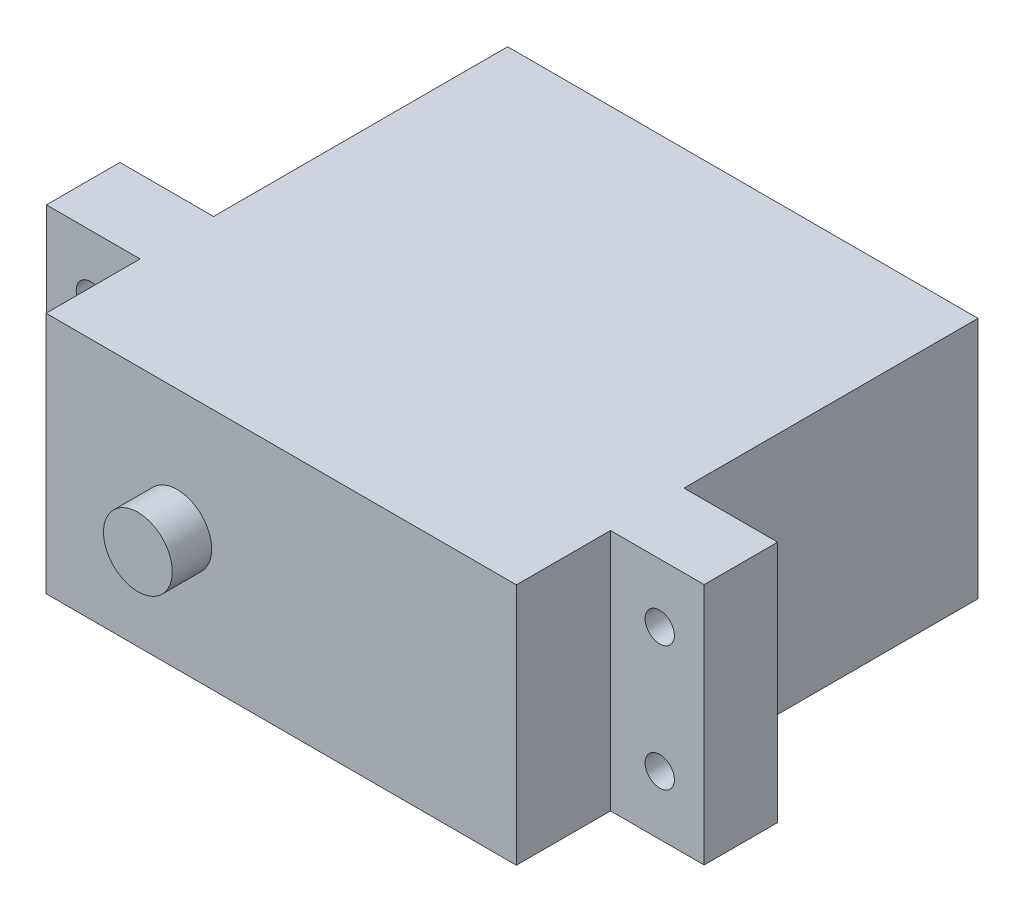
ISO-10303-21;
HEADER;
FILE_DESCRIPTION(('STEP AP214'),'2;1');
FILE_NAME('part.step','',(''),(''),'','','');
FILE_SCHEMA(('AUTOMOTIVE_DESIGN { 1 0 10303 214 1 1 1 1 }'));
ENDSEC;
DATA;
#1=APPLICATION_CONTEXT('core data for automotive mechanical design processes');
#2=APPLICATION_PROTOCOL_DEFINITION('international standard','automotive_design',2000,#1);
#3=PRODUCT_CONTEXT('',#1,'mechanical');
#4=PRODUCT('Part','Part','',(#3));
#5=PRODUCT_RELATED_PRODUCT_CATEGORY('part','',(#4));
#6=PRODUCT_DEFINITION_FORMATION('','',#4);
#7=PRODUCT_DEFINITION_CONTEXT('part definition',#1,'design');
#8=PRODUCT_DEFINITION('design','',#6,#7);
#9=PRODUCT_DEFINITION_SHAPE('','',#8);
#10=(LENGTH_UNIT() NAMED_UNIT(*) SI_UNIT(.MILLI.,.METRE.));
#11=(NAMED_UNIT(*) PLANE_ANGLE_UNIT() SI_UNIT($,.RADIAN.));
#12=(NAMED_UNIT(*) SI_UNIT($,.STERADIAN.) SOLID_ANGLE_UNIT());
#13=UNCERTAINTY_MEASURE_WITH_UNIT(LENGTH_MEASURE(1.E-05),#10,'distance_accuracy_value','');
#14=(GEOMETRIC_REPRESENTATION_CONTEXT(3) GLOBAL_UNCERTAINTY_ASSIGNED_CONTEXT((#13)) GLOBAL_UNIT_ASSIGNED_CONTEXT((#10,
#11,#12)) REPRESENTATION_CONTEXT('',''));
#15=CARTESIAN_POINT('',(0.,0.,0.));
#16=DIRECTION('',(0.,0.,1.));
#17=DIRECTION('',(1.,0.,0.));
#18=AXIS2_PLACEMENT_3D('',#15,#16,#17);
#19=CARTESIAN_POINT('',(-28.4099,-10.4902,43.2816));
#20=DIRECTION('',(1.,0.,0.));
#21=DIRECTION('',(0.,0.,-1.));
#22=AXIS2_PLACEMENT_3D('',#19,#20,#21);
#23=PLANE('',#22);
#24=DIRECTION('',(0.,0.,-1.));
#25=VECTOR('',#24,1.);
#26=CARTESIAN_POINT('',(-28.4099,-10.4902,43.2816));
#27=LINE('',#26,#25);
#28=CARTESIAN_POINT('',(-28.4099,-10.4902,31.75));
#29=VERTEX_POINT('',#28);
#30=CARTESIAN_POINT('',(-28.4099,-10.4902,25.4));
#31=VERTEX_POINT('',#30);
#32=EDGE_CURVE('E50',#29,#31,#27,.T.);
#33=ORIENTED_EDGE('',*,*,#32,.F.);
#34=DIRECTION('',(0.,-1.,0.));
#35=VECTOR('',#34,1.);
#36=CARTESIAN_POINT('',(-28.4099,-10.4902,31.75));
#37=LINE('',#36,#35);
#38=CARTESIAN_POINT('',(-28.4099,10.4902,31.75));
#39=VERTEX_POINT('',#38);
#40=EDGE_CURVE('E179',#39,#29,#37,.T.);
#41=ORIENTED_EDGE('',*,*,#40,.F.);
#42=DIRECTION('',(0.,0.,-1.));
#43=VECTOR('',#42,1.);
#44=CARTESIAN_POINT('',(-28.4099,10.4902,43.2816));
#45=LINE('',#44,#43);
#46=CARTESIAN_POINT('',(-28.4099,10.4902,25.4));
#47=VERTEX_POINT('',#46);
#48=EDGE_CURVE('E271',#39,#47,#45,.T.);
#49=ORIENTED_EDGE('',*,*,#48,.T.);
#50=DIRECTION('',(0.,1.,0.));
#51=VECTOR('',#50,1.);
#52=CARTESIAN_POINT('',(-28.4099,10.4902,25.4));
#53=LINE('',#52,#51);
#54=EDGE_CURVE('E207',#31,#47,#53,.T.);
#55=ORIENTED_EDGE('',*,*,#54,.F.);
#56=EDGE_LOOP('',(#33,#41,#49,#55));
#57=FACE_BOUND('',#56,.T.);
#58=ADVANCED_FACE('F41',(#57),#23,.F.);
#59=CARTESIAN_POINT('',(-28.4099,-10.4902,43.2816));
#60=DIRECTION('',(0.,1.,0.));
#61=DIRECTION('',(0.,0.,1.));
#62=AXIS2_PLACEMENT_3D('',#59,#60,#61);
#63=PLANE('',#62);
#64=DIRECTION('',(1.,0.,0.));
#65=VECTOR('',#64,1.);
#66=CARTESIAN_POINT('',(28.4099,-10.4902,31.75));
#67=LINE('',#66,#65);
#68=CARTESIAN_POINT('',(20.32,-10.4902,31.75));
#69=VERTEX_POINT('',#68);
#70=CARTESIAN_POINT('',(28.4099,-10.4902,31.75));
#71=VERTEX_POINT('',#70);
#72=EDGE_CURVE('E149',#69,#71,#67,.T.);
#73=ORIENTED_EDGE('',*,*,#72,.F.);
#74=DIRECTION('',(0.,0.,1.));
#75=VECTOR('',#74,1.);
#76=CARTESIAN_POINT('',(20.32,-10.4902,31.75));
#77=LINE('',#76,#75);
#78=CARTESIAN_POINT('',(20.32,-10.4902,39.878));
#79=VERTEX_POINT('',#78);
#80=EDGE_CURVE('E145',#69,#79,#77,.T.);
#81=ORIENTED_EDGE('',*,*,#80,.T.);
#82=DIRECTION('',(1.,0.,0.));
#83=VECTOR('',#82,1.);
#84=CARTESIAN_POINT('',(-28.4099,-10.4902,39.878));
#85=LINE('',#84,#83);
#86=CARTESIAN_POINT('',(-20.32,-10.4902,39.878));
#87=VERTEX_POINT('',#86);
#88=EDGE_CURVE('E257',#87,#79,#85,.T.);
#89=ORIENTED_EDGE('',*,*,#88,.F.);
#90=DIRECTION('',(0.,0.,1.));
#91=VECTOR('',#90,1.);
#92=CARTESIAN_POINT('',(-20.32,-10.4902,31.75));
#93=LINE('',#92,#91);
#94=CARTESIAN_POINT('',(-20.32,-10.4902,31.75));
#95=VERTEX_POINT('',#94);
#96=EDGE_CURVE('E68',#95,#87,#93,.T.);
#97=ORIENTED_EDGE('',*,*,#96,.F.);
#98=DIRECTION('',(1.,0.,0.));
#99=VECTOR('',#98,1.);
#100=CARTESIAN_POINT('',(-20.32,-10.4902,31.75));
#101=LINE('',#100,#99);
#102=EDGE_CURVE('E181',#29,#95,#101,.T.);
#103=ORIENTED_EDGE('',*,*,#102,.F.);
#104=ORIENTED_EDGE('',*,*,#32,.T.);
#105=DIRECTION('',(-1.,0.,0.));
#106=VECTOR('',#105,1.);
#107=CARTESIAN_POINT('',(-28.4099,-10.4902,25.4));
#108=LINE('',#107,#106);
#109=CARTESIAN_POINT('',(-20.32,-10.4902,25.4));
#110=VERTEX_POINT('',#109);
#111=EDGE_CURVE('E216',#110,#31,#108,.T.);
#112=ORIENTED_EDGE('',*,*,#111,.F.);
#113=DIRECTION('',(0.,0.,-1.));
#114=VECTOR('',#113,1.);
#115=CARTESIAN_POINT('',(-20.32,-10.4902,25.4));
#116=LINE('',#115,#114);
#117=CARTESIAN_POINT('',(-20.32,-10.4902,0.));
#118=VERTEX_POINT('',#117);
#119=EDGE_CURVE('E221',#110,#118,#116,.T.);
#120=ORIENTED_EDGE('',*,*,#119,.T.);
#121=DIRECTION('',(1.,0.,0.));
#122=VECTOR('',#121,1.);
#123=CARTESIAN_POINT('',(-28.4099,-10.4902,0.));
#124=LINE('',#123,#122);
#125=CARTESIAN_POINT('',(20.32,-10.4902,0.));
#126=VERTEX_POINT('',#125);
#127=EDGE_CURVE('E264',#118,#126,#124,.T.);
#128=ORIENTED_EDGE('',*,*,#127,.T.);
#129=DIRECTION('',(0.,0.,-1.));
#130=VECTOR('',#129,1.);
#131=CARTESIAN_POINT('',(20.32,-10.4902,25.4));
#132=LINE('',#131,#130);
#133=CARTESIAN_POINT('',(20.32,-10.4902,25.4));
#134=VERTEX_POINT('',#133);
#135=EDGE_CURVE('E242',#134,#126,#132,.T.);
#136=ORIENTED_EDGE('',*,*,#135,.F.);
#137=DIRECTION('',(-1.,0.,0.));
#138=VECTOR('',#137,1.);
#139=CARTESIAN_POINT('',(20.32,-10.4902,25.4));
#140=LINE('',#139,#138);
#141=CARTESIAN_POINT('',(28.4099,-10.4902,25.4));
#142=VERTEX_POINT('',#141);
#143=EDGE_CURVE('E226',#142,#134,#140,.T.);
#144=ORIENTED_EDGE('',*,*,#143,.F.);
#145=DIRECTION('',(0.,0.,-1.));
#146=VECTOR('',#145,1.);
#147=CARTESIAN_POINT('',(28.4099,-10.4902,43.2816));
#148=LINE('',#147,#146);
#149=EDGE_CURVE('E276',#71,#142,#148,.T.);
#150=ORIENTED_EDGE('',*,*,#149,.F.);
#151=EDGE_LOOP('',(#73,#81,#89,#97,#103,#104,#112,#120,#128,#136,#144,#150));
#152=FACE_BOUND('',#151,.T.);
#153=ADVANCED_FACE('F331',(#152),#63,.F.);
#154=CARTESIAN_POINT('',(28.4099,-10.4902,43.2816));
#155=DIRECTION('',(-1.,0.,0.));
#156=DIRECTION('',(0.,-1.,0.));
#157=AXIS2_PLACEMENT_3D('',#154,#155,#156);
#158=PLANE('',#157);
#159=DIRECTION('',(0.,0.,-1.));
#160=VECTOR('',#159,1.);
#161=CARTESIAN_POINT('',(28.4099,10.4902,43.2816));
#162=LINE('',#161,#160);
#163=CARTESIAN_POINT('',(28.4099,10.4902,31.75));
#164=VERTEX_POINT('',#163);
#165=CARTESIAN_POINT('',(28.4099,10.4902,25.4));
#166=VERTEX_POINT('',#165);
#167=EDGE_CURVE('E273',#164,#166,#162,.T.);
#168=ORIENTED_EDGE('',*,*,#167,.F.);
#169=DIRECTION('',(0.,1.,0.));
#170=VECTOR('',#169,1.);
#171=CARTESIAN_POINT('',(28.4099,10.4902,31.75));
#172=LINE('',#171,#170);
#173=EDGE_CURVE('E156',#71,#164,#172,.T.);
#174=ORIENTED_EDGE('',*,*,#173,.F.);
#175=ORIENTED_EDGE('',*,*,#149,.T.);
#176=DIRECTION('',(0.,-1.,0.));
#177=VECTOR('',#176,1.);
#178=CARTESIAN_POINT('',(28.4099,-10.4902,25.4));
#179=LINE('',#178,#177);
#180=EDGE_CURVE('E238',#166,#142,#179,.T.);
#181=ORIENTED_EDGE('',*,*,#180,.F.);
#182=EDGE_LOOP('',(#168,#174,#175,#181));
#183=FACE_BOUND('',#182,.T.);
#184=ADVANCED_FACE('F341',(#183),#158,.F.);
#185=CARTESIAN_POINT('',(-28.4099,10.4902,43.2816));
#186=DIRECTION('',(0.,-1.,0.));
#187=DIRECTION('',(0.,0.,-1.));
#188=AXIS2_PLACEMENT_3D('',#185,#186,#187);
#189=PLANE('',#188);
#190=DIRECTION('',(-1.,0.,0.));
#191=VECTOR('',#190,1.);
#192=CARTESIAN_POINT('',(-28.4099,10.4902,39.878));
#193=LINE('',#192,#191);
#194=CARTESIAN_POINT('',(20.32,10.4902,39.878));
#195=VERTEX_POINT('',#194);
#196=CARTESIAN_POINT('',(-20.32,10.4902,39.878));
#197=VERTEX_POINT('',#196);
#198=EDGE_CURVE('E12',#195,#197,#193,.T.);
#199=ORIENTED_EDGE('',*,*,#198,.F.);
#200=DIRECTION('',(0.,0.,1.));
#201=VECTOR('',#200,1.);
#202=CARTESIAN_POINT('',(20.32,10.4902,31.75));
#203=LINE('',#202,#201);
#204=CARTESIAN_POINT('',(20.32,10.4902,31.75));
#205=VERTEX_POINT('',#204);
#206=EDGE_CURVE('E60',#205,#195,#203,.T.);
#207=ORIENTED_EDGE('',*,*,#206,.F.);
#208=DIRECTION('',(-1.,0.,0.));
#209=VECTOR('',#208,1.);
#210=CARTESIAN_POINT('',(20.32,10.4902,31.75));
#211=LINE('',#210,#209);
#212=EDGE_CURVE('E150',#164,#205,#211,.T.);
#213=ORIENTED_EDGE('',*,*,#212,.F.);
#214=ORIENTED_EDGE('',*,*,#167,.T.);
#215=DIRECTION('',(1.,0.,0.));
#216=VECTOR('',#215,1.);
#217=CARTESIAN_POINT('',(28.4099,10.4902,25.4));
#218=LINE('',#217,#216);
#219=CARTESIAN_POINT('',(20.32,10.4902,25.4));
#220=VERTEX_POINT('',#219);
#221=EDGE_CURVE('E234',#220,#166,#218,.T.);
#222=ORIENTED_EDGE('',*,*,#221,.F.);
#223=DIRECTION('',(0.,0.,-1.));
#224=VECTOR('',#223,1.);
#225=CARTESIAN_POINT('',(20.32,10.4902,25.4));
#226=LINE('',#225,#224);
#227=CARTESIAN_POINT('',(20.32,10.4902,0.));
#228=VERTEX_POINT('',#227);
#229=EDGE_CURVE('E245',#220,#228,#226,.T.);
#230=ORIENTED_EDGE('',*,*,#229,.T.);
#231=DIRECTION('',(-1.,0.,0.));
#232=VECTOR('',#231,1.);
#233=CARTESIAN_POINT('',(-28.4099,10.4902,0.));
#234=LINE('',#233,#232);
#235=CARTESIAN_POINT('',(-20.32,10.4902,0.));
#236=VERTEX_POINT('',#235);
#237=EDGE_CURVE('E267',#228,#236,#234,.T.);
#238=ORIENTED_EDGE('',*,*,#237,.T.);
#239=DIRECTION('',(0.,0.,-1.));
#240=VECTOR('',#239,1.);
#241=CARTESIAN_POINT('',(-20.32,10.4902,25.4));
#242=LINE('',#241,#240);
#243=CARTESIAN_POINT('',(-20.32,10.4902,25.4));
#244=VERTEX_POINT('',#243);
#245=EDGE_CURVE('E219',#244,#236,#242,.T.);
#246=ORIENTED_EDGE('',*,*,#245,.F.);
#247=DIRECTION('',(1.,0.,0.));
#248=VECTOR('',#247,1.);
#249=CARTESIAN_POINT('',(-20.32,10.4902,25.4));
#250=LINE('',#249,#248);
#251=EDGE_CURVE('E210',#47,#244,#250,.T.);
#252=ORIENTED_EDGE('',*,*,#251,.F.);
#253=ORIENTED_EDGE('',*,*,#48,.F.);
#254=DIRECTION('',(-1.,0.,0.));
#255=VECTOR('',#254,1.);
#256=CARTESIAN_POINT('',(-28.4099,10.4902,31.75));
#257=LINE('',#256,#255);
#258=CARTESIAN_POINT('',(-20.32,10.4902,31.75));
#259=VERTEX_POINT('',#258);
#260=EDGE_CURVE('E187',#259,#39,#257,.T.);
#261=ORIENTED_EDGE('',*,*,#260,.F.);
#262=DIRECTION('',(0.,0.,1.));
#263=VECTOR('',#262,1.);
#264=CARTESIAN_POINT('',(-20.32,10.4902,31.75));
#265=LINE('',#264,#263);
#266=EDGE_CURVE('E190',#259,#197,#265,.T.);
#267=ORIENTED_EDGE('',*,*,#266,.T.);
#268=EDGE_LOOP('',(#199,#207,#213,#214,#222,#230,#238,#246,#252,#253,#261,#267));
#269=FACE_BOUND('',#268,.T.);
#270=ADVANCED_FACE('F163',(#269),#189,.F.);
#271=CARTESIAN_POINT('',(-28.4099,10.4902,0.));
#272=DIRECTION('',(0.,0.,-1.));
#273=DIRECTION('',(-1.,0.,0.));
#274=AXIS2_PLACEMENT_3D('',#271,#272,#273);
#275=PLANE('',#274);
#276=DIRECTION('',(0.,-1.,0.));
#277=VECTOR('',#276,1.);
#278=CARTESIAN_POINT('',(-20.32,-10.4902,0.));
#279=LINE('',#278,#277);
#280=EDGE_CURVE('E206',#236,#118,#279,.T.);
#281=ORIENTED_EDGE('',*,*,#280,.F.);
#282=ORIENTED_EDGE('',*,*,#237,.F.);
#283=DIRECTION('',(0.,1.,0.));
#284=VECTOR('',#283,1.);
#285=CARTESIAN_POINT('',(20.32,10.4902,0.));
#286=LINE('',#285,#284);
#287=EDGE_CURVE('E224',#126,#228,#286,.T.);
#288=ORIENTED_EDGE('',*,*,#287,.F.);
#289=ORIENTED_EDGE('',*,*,#127,.F.);
#290=EDGE_LOOP('',(#281,#282,#288,#289));
#291=FACE_BOUND('',#290,.T.);
#292=ADVANCED_FACE('F327',(#291),#275,.T.);
#293=CARTESIAN_POINT('',(0.,0.,39.878));
#294=DIRECTION('',(0.,0.,1.));
#295=DIRECTION('',(1.,0.,0.));
#296=AXIS2_PLACEMENT_3D('',#293,#294,#295);
#297=PLANE('',#296);
#298=DIRECTION('',(0.,-1.,0.));
#299=VECTOR('',#298,1.);
#300=CARTESIAN_POINT('',(20.32,-10.4902,39.878));
#301=LINE('',#300,#299);
#302=EDGE_CURVE('E160',#195,#79,#301,.T.);
#303=ORIENTED_EDGE('',*,*,#302,.F.);
#304=ORIENTED_EDGE('',*,*,#198,.T.);
#305=DIRECTION('',(0.,1.,0.));
#306=VECTOR('',#305,1.);
#307=CARTESIAN_POINT('',(-20.32,10.4902,39.878));
#308=LINE('',#307,#306);
#309=EDGE_CURVE('E178',#87,#197,#308,.T.);
#310=ORIENTED_EDGE('',*,*,#309,.F.);
#311=ORIENTED_EDGE('',*,*,#88,.T.);
#312=EDGE_LOOP('',(#303,#304,#310,#311));
#313=FACE_BOUND('',#312,.T.);
#314=CARTESIAN_POINT('',(-8.9789,0.,39.878));
#315=DIRECTION('',(0.,0.,1.));
#316=DIRECTION('',(1.,0.,0.));
#317=AXIS2_PLACEMENT_3D('',#314,#315,#316);
#318=CIRCLE('',#317,2.9718);
#319=CARTESIAN_POINT('',(-6.0071,0.,39.878));
#320=VERTEX_POINT('',#319);
#321=EDGE_CURVE('E253',#320,#320,#318,.T.);
#322=ORIENTED_EDGE('',*,*,#321,.F.);
#323=EDGE_LOOP('',(#322));
#324=FACE_BOUND('',#323,.T.);
#325=ADVANCED_FACE('F354',(#313,#324),#297,.T.);
#326=CARTESIAN_POINT('',(-8.9789,0.,39.878));
#327=DIRECTION('',(0.,0.,1.));
#328=DIRECTION('',(1.,0.,0.));
#329=AXIS2_PLACEMENT_3D('',#326,#327,#328);
#330=CYLINDRICAL_SURFACE('',#329,2.9718);
#331=ORIENTED_EDGE('',*,*,#321,.T.);
#332=EDGE_LOOP('',(#331));
#333=FACE_BOUND('',#332,.T.);
#334=CARTESIAN_POINT('',(-8.9789,0.,43.2816));
#335=DIRECTION('',(0.,0.,1.));
#336=DIRECTION('',(1.,0.,0.));
#337=AXIS2_PLACEMENT_3D('',#334,#335,#336);
#338=CIRCLE('',#337,2.9718);
#339=CARTESIAN_POINT('',(-6.0071,0.,43.2816));
#340=VERTEX_POINT('',#339);
#341=EDGE_CURVE('E249',#340,#340,#338,.T.);
#342=ORIENTED_EDGE('',*,*,#341,.F.);
#343=EDGE_LOOP('',(#342));
#344=FACE_BOUND('',#343,.T.);
#345=ADVANCED_FACE('F388',(#333,#344),#330,.T.);
#346=CARTESIAN_POINT('',(-28.4099,10.4902,43.2816));
#347=DIRECTION('',(0.,0.,-1.));
#348=DIRECTION('',(-1.,0.,0.));
#349=AXIS2_PLACEMENT_3D('',#346,#347,#348);
#350=PLANE('',#349);
#351=ORIENTED_EDGE('',*,*,#341,.T.);
#352=EDGE_LOOP('',(#351));
#353=FACE_BOUND('',#352,.T.);
#354=ADVANCED_FACE('F387',(#353),#350,.F.);
#355=CARTESIAN_POINT('',(20.32,10.4902,25.4));
#356=DIRECTION('',(-1.,0.,0.));
#357=DIRECTION('',(0.,-1.,0.));
#358=AXIS2_PLACEMENT_3D('',#355,#356,#357);
#359=PLANE('',#358);
#360=ORIENTED_EDGE('',*,*,#287,.T.);
#361=ORIENTED_EDGE('',*,*,#229,.F.);
#362=DIRECTION('',(0.,1.,0.));
#363=VECTOR('',#362,1.);
#364=CARTESIAN_POINT('',(20.32,10.4902,25.4));
#365=LINE('',#364,#363);
#366=EDGE_CURVE('E230',#134,#220,#365,.T.);
#367=ORIENTED_EDGE('',*,*,#366,.F.);
#368=ORIENTED_EDGE('',*,*,#135,.T.);
#369=EDGE_LOOP('',(#360,#361,#367,#368));
#370=FACE_BOUND('',#369,.T.);
#371=ADVANCED_FACE('F334',(#370),#359,.F.);
#372=CARTESIAN_POINT('',(28.4099,-10.4902,25.4));
#373=DIRECTION('',(0.,0.,1.));
#374=DIRECTION('',(1.,0.,0.));
#375=AXIS2_PLACEMENT_3D('',#372,#373,#374);
#376=PLANE('',#375);
#377=CARTESIAN_POINT('',(24.5745,5.3975,25.4));
#378=DIRECTION('',(0.,0.,1.));
#379=DIRECTION('',(1.,0.,0.));
#380=AXIS2_PLACEMENT_3D('',#377,#378,#379);
#381=CIRCLE('',#380,1.26364999999999);
#382=CARTESIAN_POINT('',(25.83815,5.3975,25.4));
#383=VERTEX_POINT('',#382);
#384=EDGE_CURVE('E201',#383,#383,#381,.T.);
#385=ORIENTED_EDGE('',*,*,#384,.T.);
#386=EDGE_LOOP('',(#385));
#387=FACE_BOUND('',#386,.T.);
#388=CARTESIAN_POINT('',(24.5745,-5.3975,25.4));
#389=DIRECTION('',(0.,0.,1.));
#390=DIRECTION('',(1.,0.,0.));
#391=AXIS2_PLACEMENT_3D('',#388,#389,#390);
#392=CIRCLE('',#391,1.26364999999999);
#393=CARTESIAN_POINT('',(25.83815,-5.3975,25.4));
#394=VERTEX_POINT('',#393);
#395=EDGE_CURVE('E202',#394,#394,#392,.T.);
#396=ORIENTED_EDGE('',*,*,#395,.T.);
#397=EDGE_LOOP('',(#396));
#398=FACE_BOUND('',#397,.T.);
#399=ORIENTED_EDGE('',*,*,#143,.T.);
#400=ORIENTED_EDGE('',*,*,#366,.T.);
#401=ORIENTED_EDGE('',*,*,#221,.T.);
#402=ORIENTED_EDGE('',*,*,#180,.T.);
#403=EDGE_LOOP('',(#399,#400,#401,#402));
#404=FACE_BOUND('',#403,.T.);
#405=ADVANCED_FACE('F337',(#387,#398,#404),#376,.F.);
#406=CARTESIAN_POINT('',(-20.32,-10.4902,25.4));
#407=DIRECTION('',(1.,0.,0.));
#408=DIRECTION('',(0.,1.,0.));
#409=AXIS2_PLACEMENT_3D('',#406,#407,#408);
#410=PLANE('',#409);
#411=ORIENTED_EDGE('',*,*,#280,.T.);
#412=ORIENTED_EDGE('',*,*,#119,.F.);
#413=DIRECTION('',(0.,-1.,0.));
#414=VECTOR('',#413,1.);
#415=CARTESIAN_POINT('',(-20.32,-10.4902,25.4));
#416=LINE('',#415,#414);
#417=EDGE_CURVE('E213',#244,#110,#416,.T.);
#418=ORIENTED_EDGE('',*,*,#417,.F.);
#419=ORIENTED_EDGE('',*,*,#245,.T.);
#420=EDGE_LOOP('',(#411,#412,#418,#419));
#421=FACE_BOUND('',#420,.T.);
#422=ADVANCED_FACE('F311',(#421),#410,.F.);
#423=CARTESIAN_POINT('',(-28.4099,-10.4902,25.4));
#424=DIRECTION('',(0.,0.,1.));
#425=DIRECTION('',(1.,0.,0.));
#426=AXIS2_PLACEMENT_3D('',#423,#424,#425);
#427=PLANE('',#426);
#428=CARTESIAN_POINT('',(-24.5745,5.3975,25.4));
#429=DIRECTION('',(0.,0.,1.));
#430=DIRECTION('',(1.,0.,0.));
#431=AXIS2_PLACEMENT_3D('',#428,#429,#430);
#432=CIRCLE('',#431,1.26364999999999);
#433=CARTESIAN_POINT('',(-23.31085,5.3975,25.4));
#434=VERTEX_POINT('',#433);
#435=EDGE_CURVE('E197',#434,#434,#432,.T.);
#436=ORIENTED_EDGE('',*,*,#435,.T.);
#437=EDGE_LOOP('',(#436));
#438=FACE_BOUND('',#437,.T.);
#439=CARTESIAN_POINT('',(-24.5745,-5.3975,25.4));
#440=DIRECTION('',(0.,0.,1.));
#441=DIRECTION('',(1.,0.,0.));
#442=AXIS2_PLACEMENT_3D('',#439,#440,#441);
#443=CIRCLE('',#442,1.26364999999999);
#444=CARTESIAN_POINT('',(-23.31085,-5.3975,25.4));
#445=VERTEX_POINT('',#444);
#446=EDGE_CURVE('E198',#445,#445,#443,.T.);
#447=ORIENTED_EDGE('',*,*,#446,.T.);
#448=EDGE_LOOP('',(#447));
#449=FACE_BOUND('',#448,.T.);
#450=ORIENTED_EDGE('',*,*,#54,.T.);
#451=ORIENTED_EDGE('',*,*,#251,.T.);
#452=ORIENTED_EDGE('',*,*,#417,.T.);
#453=ORIENTED_EDGE('',*,*,#111,.T.);
#454=EDGE_LOOP('',(#450,#451,#452,#453));
#455=FACE_BOUND('',#454,.T.);
#456=ADVANCED_FACE('F307',(#438,#449,#455),#427,.F.);
#457=CARTESIAN_POINT('',(24.5745,-5.3975,39.878));
#458=DIRECTION('',(0.,0.,1.));
#459=DIRECTION('',(1.,0.,0.));
#460=AXIS2_PLACEMENT_3D('',#457,#458,#459);
#461=CYLINDRICAL_SURFACE('',#460,1.26364999999999);
#462=CARTESIAN_POINT('',(24.5745,-5.3975,31.75));
#463=DIRECTION('',(0.,0.,-1.));
#464=DIRECTION('',(-1.,0.,0.));
#465=AXIS2_PLACEMENT_3D('',#462,#463,#464);
#466=CIRCLE('',#465,1.26364999999999);
#467=CARTESIAN_POINT('',(23.31085,-5.3975,31.75));
#468=VERTEX_POINT('',#467);
#469=EDGE_CURVE('E174',#468,#468,#466,.F.);
#470=ORIENTED_EDGE('',*,*,#469,.T.);
#471=EDGE_LOOP('',(#470));
#472=FACE_BOUND('',#471,.T.);
#473=ORIENTED_EDGE('',*,*,#395,.F.);
#474=EDGE_LOOP('',(#473));
#475=FACE_BOUND('',#474,.T.);
#476=ADVANCED_FACE('F310',(#472,#475),#461,.F.);
#477=CARTESIAN_POINT('',(24.5745,5.3975,39.878));
#478=DIRECTION('',(0.,0.,1.));
#479=DIRECTION('',(1.,0.,0.));
#480=AXIS2_PLACEMENT_3D('',#477,#478,#479);
#481=CYLINDRICAL_SURFACE('',#480,1.26364999999999);
#482=CARTESIAN_POINT('',(24.5745,5.3975,31.75));
#483=DIRECTION('',(0.,0.,-1.));
#484=DIRECTION('',(-1.,0.,0.));
#485=AXIS2_PLACEMENT_3D('',#482,#483,#484);
#486=CIRCLE('',#485,1.26364999999999);
#487=CARTESIAN_POINT('',(23.31085,5.3975,31.75));
#488=VERTEX_POINT('',#487);
#489=EDGE_CURVE('E44',#488,#488,#486,.F.);
#490=ORIENTED_EDGE('',*,*,#489,.T.);
#491=EDGE_LOOP('',(#490));
#492=FACE_BOUND('',#491,.T.);
#493=ORIENTED_EDGE('',*,*,#384,.F.);
#494=EDGE_LOOP('',(#493));
#495=FACE_BOUND('',#494,.T.);
#496=ADVANCED_FACE('F303',(#492,#495),#481,.F.);
#497=CARTESIAN_POINT('',(-24.5745,-5.3975,39.878));
#498=DIRECTION('',(0.,0.,1.));
#499=DIRECTION('',(1.,0.,0.));
#500=AXIS2_PLACEMENT_3D('',#497,#498,#499);
#501=CYLINDRICAL_SURFACE('',#500,1.26364999999999);
#502=CARTESIAN_POINT('',(-24.5745,-5.3975,31.75));
#503=DIRECTION('',(0.,0.,-1.));
#504=DIRECTION('',(-1.,0.,0.));
#505=AXIS2_PLACEMENT_3D('',#502,#503,#504);
#506=CIRCLE('',#505,1.26364999999999);
#507=CARTESIAN_POINT('',(-25.83815,-5.3975,31.75));
#508=VERTEX_POINT('',#507);
#509=EDGE_CURVE('E194',#508,#508,#506,.F.);
#510=ORIENTED_EDGE('',*,*,#509,.T.);
#511=EDGE_LOOP('',(#510));
#512=FACE_BOUND('',#511,.T.);
#513=ORIENTED_EDGE('',*,*,#446,.F.);
#514=EDGE_LOOP('',(#513));
#515=FACE_BOUND('',#514,.T.);
#516=ADVANCED_FACE('F300',(#512,#515),#501,.F.);
#517=CARTESIAN_POINT('',(-24.5745,5.3975,39.878));
#518=DIRECTION('',(0.,0.,1.));
#519=DIRECTION('',(1.,0.,0.));
#520=AXIS2_PLACEMENT_3D('',#517,#518,#519);
#521=CYLINDRICAL_SURFACE('',#520,1.26364999999999);
#522=CARTESIAN_POINT('',(-24.5745,5.3975,31.75));
#523=DIRECTION('',(0.,0.,-1.));
#524=DIRECTION('',(-1.,0.,0.));
#525=AXIS2_PLACEMENT_3D('',#522,#523,#524);
#526=CIRCLE('',#525,1.26364999999999);
#527=CARTESIAN_POINT('',(-25.83815,5.3975,31.75));
#528=VERTEX_POINT('',#527);
#529=EDGE_CURVE('E192',#528,#528,#526,.F.);
#530=ORIENTED_EDGE('',*,*,#529,.T.);
#531=EDGE_LOOP('',(#530));
#532=FACE_BOUND('',#531,.T.);
#533=ORIENTED_EDGE('',*,*,#435,.F.);
#534=EDGE_LOOP('',(#533));
#535=FACE_BOUND('',#534,.T.);
#536=ADVANCED_FACE('F287',(#532,#535),#521,.F.);
#537=CARTESIAN_POINT('',(-28.4099,10.4902,31.75));
#538=DIRECTION('',(0.,0.,-1.));
#539=DIRECTION('',(-1.,0.,0.));
#540=AXIS2_PLACEMENT_3D('',#537,#538,#539);
#541=PLANE('',#540);
#542=ORIENTED_EDGE('',*,*,#529,.F.);
#543=EDGE_LOOP('',(#542));
#544=FACE_BOUND('',#543,.T.);
#545=ORIENTED_EDGE('',*,*,#40,.T.);
#546=ORIENTED_EDGE('',*,*,#102,.T.);
#547=DIRECTION('',(0.,1.,0.));
#548=VECTOR('',#547,1.);
#549=CARTESIAN_POINT('',(-20.32,10.4902,31.75));
#550=LINE('',#549,#548);
#551=EDGE_CURVE('E184',#95,#259,#550,.T.);
#552=ORIENTED_EDGE('',*,*,#551,.T.);
#553=ORIENTED_EDGE('',*,*,#260,.T.);
#554=EDGE_LOOP('',(#545,#546,#552,#553));
#555=FACE_BOUND('',#554,.T.);
#556=ORIENTED_EDGE('',*,*,#509,.F.);
#557=EDGE_LOOP('',(#556));
#558=FACE_BOUND('',#557,.T.);
#559=ADVANCED_FACE('F290',(#544,#555,#558),#541,.F.);
#560=CARTESIAN_POINT('',(-20.32,10.4902,31.75));
#561=DIRECTION('',(1.,0.,0.));
#562=DIRECTION('',(0.,1.,0.));
#563=AXIS2_PLACEMENT_3D('',#560,#561,#562);
#564=PLANE('',#563);
#565=ORIENTED_EDGE('',*,*,#309,.T.);
#566=ORIENTED_EDGE('',*,*,#266,.F.);
#567=ORIENTED_EDGE('',*,*,#551,.F.);
#568=ORIENTED_EDGE('',*,*,#96,.T.);
#569=EDGE_LOOP('',(#565,#566,#567,#568));
#570=FACE_BOUND('',#569,.T.);
#571=ADVANCED_FACE('F293',(#570),#564,.F.);
#572=CARTESIAN_POINT('',(28.4099,10.4902,31.75));
#573=DIRECTION('',(0.,0.,-1.));
#574=DIRECTION('',(-1.,0.,0.));
#575=AXIS2_PLACEMENT_3D('',#572,#573,#574);
#576=PLANE('',#575);
#577=ORIENTED_EDGE('',*,*,#489,.F.);
#578=EDGE_LOOP('',(#577));
#579=FACE_BOUND('',#578,.T.);
#580=ORIENTED_EDGE('',*,*,#212,.T.);
#581=DIRECTION('',(0.,-1.,0.));
#582=VECTOR('',#581,1.);
#583=CARTESIAN_POINT('',(20.32,-10.4902,31.75));
#584=LINE('',#583,#582);
#585=EDGE_CURVE('E141',#205,#69,#584,.T.);
#586=ORIENTED_EDGE('',*,*,#585,.T.);
#587=ORIENTED_EDGE('',*,*,#72,.T.);
#588=ORIENTED_EDGE('',*,*,#173,.T.);
#589=EDGE_LOOP('',(#580,#586,#587,#588));
#590=FACE_BOUND('',#589,.T.);
#591=ORIENTED_EDGE('',*,*,#469,.F.);
#592=EDGE_LOOP('',(#591));
#593=FACE_BOUND('',#592,.T.);
#594=ADVANCED_FACE('F153',(#579,#590,#593),#576,.F.);
#595=CARTESIAN_POINT('',(20.32,-10.4902,31.75));
#596=DIRECTION('',(-1.,0.,0.));
#597=DIRECTION('',(0.,0.,1.));
#598=AXIS2_PLACEMENT_3D('',#595,#596,#597);
#599=PLANE('',#598);
#600=ORIENTED_EDGE('',*,*,#302,.T.);
#601=ORIENTED_EDGE('',*,*,#80,.F.);
#602=ORIENTED_EDGE('',*,*,#585,.F.);
#603=ORIENTED_EDGE('',*,*,#206,.T.);
#604=EDGE_LOOP('',(#600,#601,#602,#603));
#605=FACE_BOUND('',#604,.T.);
#606=ADVANCED_FACE('F143',(#605),#599,.F.);
#607=CLOSED_SHELL('',(#58,#153,#184,#270,#292,#325,#345,#354,#371,#405,#422,#456,#476,#496,#516,
#536,#559,#571,#594,#606));
#608=MANIFOLD_SOLID_BREP('B2',#607);
#609=ADVANCED_BREP_SHAPE_REPRESENTATION('',(#18,#608),#14);
#610=SHAPE_DEFINITION_REPRESENTATION(#9,#609);
ENDSEC;
END-ISO-10303-21;
